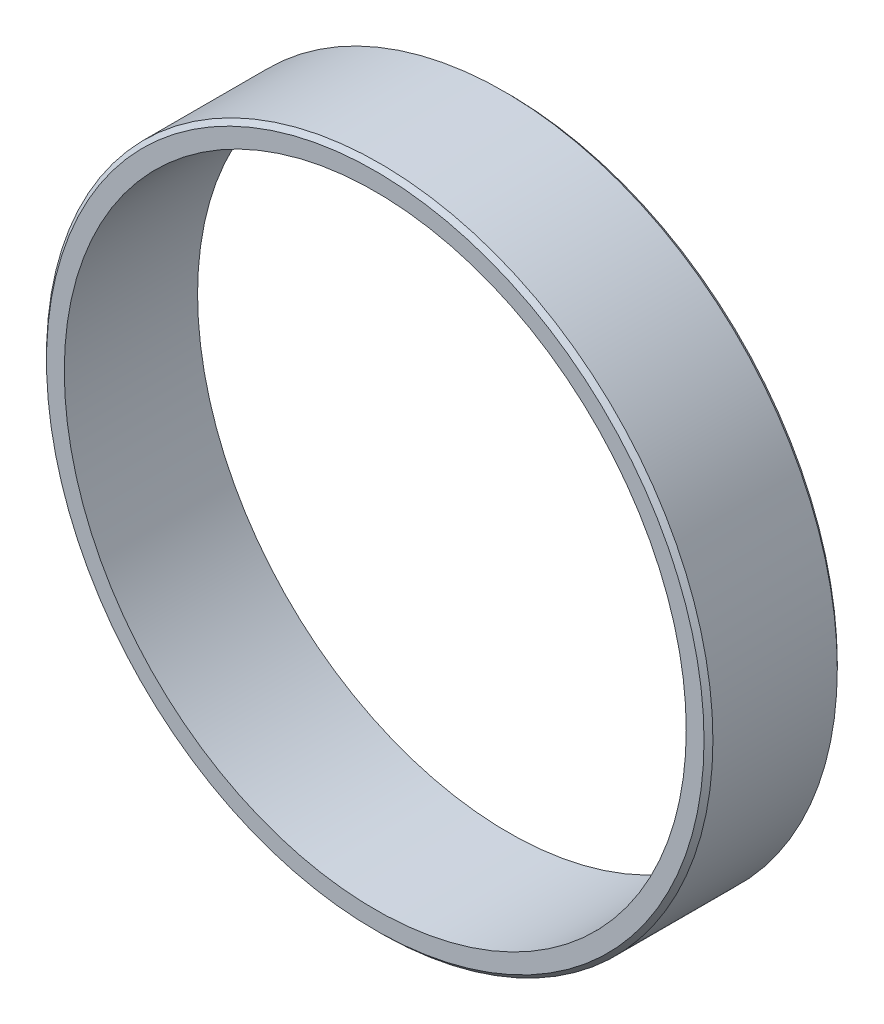
ISO-10303-21;
HEADER;
FILE_DESCRIPTION(('STEP AP214'),'2;1');
FILE_NAME('part.step','',(''),(''),'','','');
FILE_SCHEMA(('AUTOMOTIVE_DESIGN { 1 0 10303 214 1 1 1 1 }'));
ENDSEC;
DATA;
#1=APPLICATION_CONTEXT('core data for automotive mechanical design processes');
#2=APPLICATION_PROTOCOL_DEFINITION('international standard','automotive_design',2000,#1);
#3=PRODUCT_CONTEXT('',#1,'mechanical');
#4=PRODUCT('Part','Part','',(#3));
#5=PRODUCT_RELATED_PRODUCT_CATEGORY('part','',(#4));
#6=PRODUCT_DEFINITION_FORMATION('','',#4);
#7=PRODUCT_DEFINITION_CONTEXT('part definition',#1,'design');
#8=PRODUCT_DEFINITION('design','',#6,#7);
#9=PRODUCT_DEFINITION_SHAPE('','',#8);
#10=(LENGTH_UNIT() NAMED_UNIT(*) SI_UNIT(.MILLI.,.METRE.));
#11=(NAMED_UNIT(*) PLANE_ANGLE_UNIT() SI_UNIT($,.RADIAN.));
#12=(NAMED_UNIT(*) SI_UNIT($,.STERADIAN.) SOLID_ANGLE_UNIT());
#13=UNCERTAINTY_MEASURE_WITH_UNIT(LENGTH_MEASURE(1.E-05),#10,'distance_accuracy_value','');
#14=(GEOMETRIC_REPRESENTATION_CONTEXT(3) GLOBAL_UNCERTAINTY_ASSIGNED_CONTEXT((#13)) GLOBAL_UNIT_ASSIGNED_CONTEXT((#10,
#11,#12)) REPRESENTATION_CONTEXT('',''));
#15=CARTESIAN_POINT('',(0.,0.,0.));
#16=DIRECTION('',(0.,0.,1.));
#17=DIRECTION('',(1.,0.,0.));
#18=AXIS2_PLACEMENT_3D('',#15,#16,#17);
#19=CARTESIAN_POINT('',(0.,0.,7.5));
#20=DIRECTION('',(0.,0.,1.));
#21=DIRECTION('',(1.,0.,0.));
#22=AXIS2_PLACEMENT_3D('',#19,#20,#21);
#23=PLANE('',#22);
#24=CARTESIAN_POINT('',(0.,0.,7.5));
#25=DIRECTION('',(0.,0.,1.));
#26=DIRECTION('',(1.,0.,0.));
#27=AXIS2_PLACEMENT_3D('',#24,#25,#26);
#28=CIRCLE('',#27,37.);
#29=CARTESIAN_POINT('',(37.,0.,7.5));
#30=VERTEX_POINT('',#29);
#31=EDGE_CURVE('E10',#30,#30,#28,.T.);
#32=ORIENTED_EDGE('',*,*,#31,.T.);
#33=EDGE_LOOP('',(#32));
#34=FACE_BOUND('',#33,.T.);
#35=CARTESIAN_POINT('',(0.,0.,7.5));
#36=DIRECTION('',(0.,0.,1.));
#37=DIRECTION('',(1.,0.,0.));
#38=AXIS2_PLACEMENT_3D('',#35,#36,#37);
#39=CIRCLE('',#38,35.);
#40=CARTESIAN_POINT('',(35.,0.,7.5));
#41=VERTEX_POINT('',#40);
#42=EDGE_CURVE('E60',#41,#41,#39,.T.);
#43=ORIENTED_EDGE('',*,*,#42,.F.);
#44=EDGE_LOOP('',(#43));
#45=FACE_BOUND('',#44,.T.);
#46=ADVANCED_FACE('F39',(#34,#45),#23,.T.);
#47=CARTESIAN_POINT('',(0.,0.,-7.5));
#48=DIRECTION('',(0.,0.,1.));
#49=DIRECTION('',(1.,0.,0.));
#50=AXIS2_PLACEMENT_3D('',#47,#48,#49);
#51=PLANE('',#50);
#52=CARTESIAN_POINT('',(0.,0.,-7.5));
#53=DIRECTION('',(0.,0.,1.));
#54=DIRECTION('',(1.,0.,0.));
#55=AXIS2_PLACEMENT_3D('',#52,#53,#54);
#56=CIRCLE('',#55,37.);
#57=CARTESIAN_POINT('',(37.,0.,-7.5));
#58=VERTEX_POINT('',#57);
#59=EDGE_CURVE('E47',#58,#58,#56,.F.);
#60=ORIENTED_EDGE('',*,*,#59,.T.);
#61=EDGE_LOOP('',(#60));
#62=FACE_BOUND('',#61,.T.);
#63=CARTESIAN_POINT('',(0.,0.,-7.5));
#64=DIRECTION('',(0.,0.,1.));
#65=DIRECTION('',(1.,0.,0.));
#66=AXIS2_PLACEMENT_3D('',#63,#64,#65);
#67=CIRCLE('',#66,35.);
#68=CARTESIAN_POINT('',(35.,0.,-7.5));
#69=VERTEX_POINT('',#68);
#70=EDGE_CURVE('E61',#69,#69,#67,.T.);
#71=ORIENTED_EDGE('',*,*,#70,.T.);
#72=EDGE_LOOP('',(#71));
#73=FACE_BOUND('',#72,.T.);
#74=ADVANCED_FACE('F71',(#62,#73),#51,.F.);
#75=CARTESIAN_POINT('',(0.,0.,7.5));
#76=DIRECTION('',(0.,0.,-1.));
#77=DIRECTION('',(-1.,0.,0.));
#78=AXIS2_PLACEMENT_3D('',#75,#76,#77);
#79=CYLINDRICAL_SURFACE('',#78,37.5);
#80=CARTESIAN_POINT('',(0.,0.,-6.99999999999999));
#81=DIRECTION('',(0.,0.,1.));
#82=DIRECTION('',(1.,0.,0.));
#83=AXIS2_PLACEMENT_3D('',#80,#81,#82);
#84=CIRCLE('',#83,37.5);
#85=CARTESIAN_POINT('',(37.5,0.,-6.99999999999999));
#86=VERTEX_POINT('',#85);
#87=EDGE_CURVE('E51',#86,#86,#84,.T.);
#88=ORIENTED_EDGE('',*,*,#87,.T.);
#89=EDGE_LOOP('',(#88));
#90=FACE_BOUND('',#89,.T.);
#91=CARTESIAN_POINT('',(0.,0.,7.00000000000003));
#92=DIRECTION('',(0.,0.,1.));
#93=DIRECTION('',(1.,0.,0.));
#94=AXIS2_PLACEMENT_3D('',#91,#92,#93);
#95=CIRCLE('',#94,37.5);
#96=CARTESIAN_POINT('',(37.5,0.,7.00000000000003));
#97=VERTEX_POINT('',#96);
#98=EDGE_CURVE('E55',#97,#97,#95,.F.);
#99=ORIENTED_EDGE('',*,*,#98,.T.);
#100=EDGE_LOOP('',(#99));
#101=FACE_BOUND('',#100,.T.);
#102=ADVANCED_FACE('F76',(#90,#101),#79,.T.);
#103=CARTESIAN_POINT('',(0.,0.,7.5));
#104=DIRECTION('',(0.,0.,-1.));
#105=DIRECTION('',(-1.,0.,0.));
#106=AXIS2_PLACEMENT_3D('',#103,#104,#105);
#107=CYLINDRICAL_SURFACE('',#106,35.);
#108=ORIENTED_EDGE('',*,*,#42,.T.);
#109=EDGE_LOOP('',(#108));
#110=FACE_BOUND('',#109,.T.);
#111=ORIENTED_EDGE('',*,*,#70,.F.);
#112=EDGE_LOOP('',(#111));
#113=FACE_BOUND('',#112,.T.);
#114=ADVANCED_FACE('F67',(#110,#113),#107,.F.);
#115=CARTESIAN_POINT('',(0.,0.,-6.99999999999999));
#116=DIRECTION('',(0.,0.,1.));
#117=DIRECTION('',(1.,0.,0.));
#118=AXIS2_PLACEMENT_3D('',#115,#116,#117);
#119=CONICAL_SURFACE('',#118,37.5,0.785398163397455);
#120=ORIENTED_EDGE('',*,*,#59,.F.);
#121=EDGE_LOOP('',(#120));
#122=FACE_BOUND('',#121,.T.);
#123=ORIENTED_EDGE('',*,*,#87,.F.);
#124=EDGE_LOOP('',(#123));
#125=FACE_BOUND('',#124,.T.);
#126=ADVANCED_FACE('F83',(#122,#125),#119,.T.);
#127=CARTESIAN_POINT('',(0.,0.,7.5));
#128=DIRECTION('',(0.,0.,-1.));
#129=DIRECTION('',(-1.,0.,0.));
#130=AXIS2_PLACEMENT_3D('',#127,#128,#129);
#131=CONICAL_SURFACE('',#130,37.,0.785398163397455);
#132=ORIENTED_EDGE('',*,*,#98,.F.);
#133=EDGE_LOOP('',(#132));
#134=FACE_BOUND('',#133,.T.);
#135=ORIENTED_EDGE('',*,*,#31,.F.);
#136=EDGE_LOOP('',(#135));
#137=FACE_BOUND('',#136,.T.);
#138=ADVANCED_FACE('F42',(#134,#137),#131,.T.);
#139=CLOSED_SHELL('',(#46,#74,#102,#114,#126,#138));
#140=MANIFOLD_SOLID_BREP('B2',#139);
#141=ADVANCED_BREP_SHAPE_REPRESENTATION('',(#18,#140),#14);
#142=SHAPE_DEFINITION_REPRESENTATION(#9,#141);
ENDSEC;
END-ISO-10303-21;
